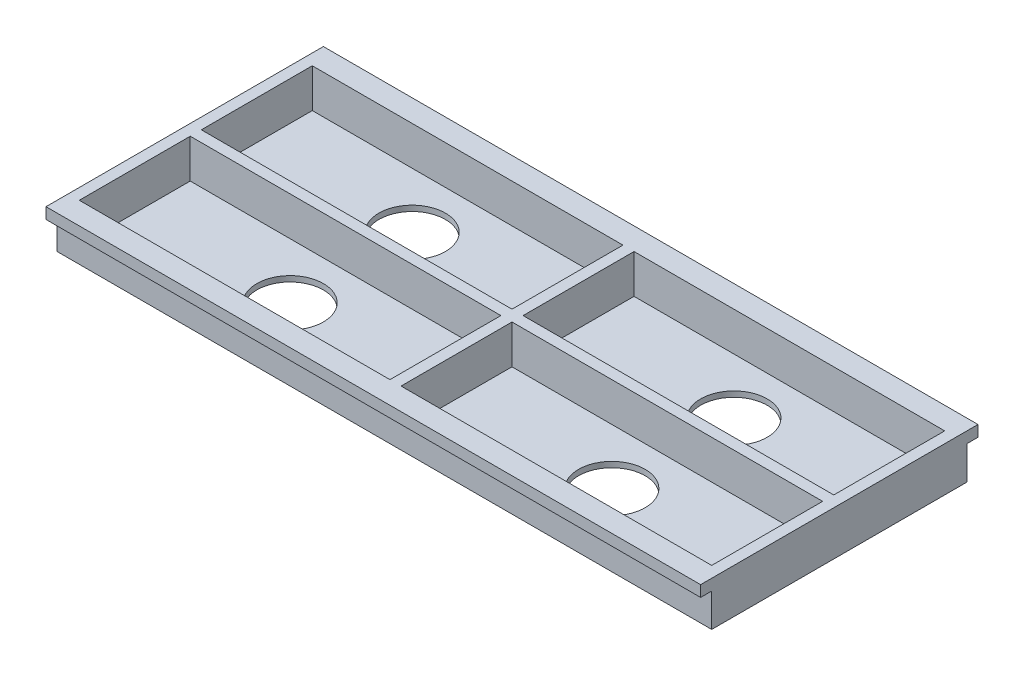
ISO-10303-21;
HEADER;
FILE_DESCRIPTION(('STEP AP214'),'2;1');
FILE_NAME('part.step','',(''),(''),'','','');
FILE_SCHEMA(('AUTOMOTIVE_DESIGN { 1 0 10303 214 1 1 1 1 }'));
ENDSEC;
DATA;
#1=APPLICATION_CONTEXT('core data for automotive mechanical design processes');
#2=APPLICATION_PROTOCOL_DEFINITION('international standard','automotive_design',2000,#1);
#3=PRODUCT_CONTEXT('',#1,'mechanical');
#4=PRODUCT('Part','Part','',(#3));
#5=PRODUCT_RELATED_PRODUCT_CATEGORY('part','',(#4));
#6=PRODUCT_DEFINITION_FORMATION('','',#4);
#7=PRODUCT_DEFINITION_CONTEXT('part definition',#1,'design');
#8=PRODUCT_DEFINITION('design','',#6,#7);
#9=PRODUCT_DEFINITION_SHAPE('','',#8);
#10=(LENGTH_UNIT() NAMED_UNIT(*) SI_UNIT(.MILLI.,.METRE.));
#11=(NAMED_UNIT(*) PLANE_ANGLE_UNIT() SI_UNIT($,.RADIAN.));
#12=(NAMED_UNIT(*) SI_UNIT($,.STERADIAN.) SOLID_ANGLE_UNIT());
#13=UNCERTAINTY_MEASURE_WITH_UNIT(LENGTH_MEASURE(1.E-05),#10,'distance_accuracy_value','');
#14=(GEOMETRIC_REPRESENTATION_CONTEXT(3) GLOBAL_UNCERTAINTY_ASSIGNED_CONTEXT((#13)) GLOBAL_UNIT_ASSIGNED_CONTEXT((#10,
#11,#12)) REPRESENTATION_CONTEXT('',''));
#15=CARTESIAN_POINT('',(0.,0.,0.));
#16=DIRECTION('',(0.,0.,1.));
#17=DIRECTION('',(1.,0.,0.));
#18=AXIS2_PLACEMENT_3D('',#15,#16,#17);
#19=CARTESIAN_POINT('',(0.,-4.99999999999999,0.));
#20=DIRECTION('',(0.,-1.,0.));
#21=DIRECTION('',(0.,0.,-1.));
#22=AXIS2_PLACEMENT_3D('',#19,#20,#21);
#23=PLANE('',#22);
#24=DIRECTION('',(1.,0.,0.));
#25=VECTOR('',#24,1.);
#26=CARTESIAN_POINT('',(0.,-4.99999999999999,-80.7628298837464));
#27=LINE('',#26,#25);
#28=CARTESIAN_POINT('',(-123.155339805825,-4.99999999999999,-80.7628298837464));
#29=VERTEX_POINT('',#28);
#30=CARTESIAN_POINT('',(171.844660194175,-4.99999999999999,-80.7628298837464));
#31=VERTEX_POINT('',#30);
#32=EDGE_CURVE('E426',#29,#31,#27,.T.);
#33=ORIENTED_EDGE('',*,*,#32,.F.);
#34=DIRECTION('',(0.,0.,1.));
#35=VECTOR('',#34,1.);
#36=CARTESIAN_POINT('',(-123.155339805825,-4.99999999999999,-85.7628298837464));
#37=LINE('',#36,#35);
#38=CARTESIAN_POINT('',(-123.155339805825,-4.99999999999999,-85.7628298837464));
#39=VERTEX_POINT('',#38);
#40=EDGE_CURVE('E444',#39,#29,#37,.T.);
#41=ORIENTED_EDGE('',*,*,#40,.F.);
#42=DIRECTION('',(1.,0.,0.));
#43=VECTOR('',#42,1.);
#44=CARTESIAN_POINT('',(-123.155339805825,-4.99999999999999,-85.7628298837464));
#45=LINE('',#44,#43);
#46=CARTESIAN_POINT('',(171.844660194175,-4.99999999999999,-85.7628298837464));
#47=VERTEX_POINT('',#46);
#48=EDGE_CURVE('E440',#39,#47,#45,.T.);
#49=ORIENTED_EDGE('',*,*,#48,.T.);
#50=DIRECTION('',(0.,0.,1.));
#51=VECTOR('',#50,1.);
#52=CARTESIAN_POINT('',(171.844660194175,-4.99999999999999,-85.7628298837464));
#53=LINE('',#52,#51);
#54=EDGE_CURVE('E437',#47,#31,#53,.T.);
#55=ORIENTED_EDGE('',*,*,#54,.T.);
#56=EDGE_LOOP('',(#33,#41,#49,#55));
#57=FACE_BOUND('',#56,.T.);
#58=ADVANCED_FACE('F43',(#57),#23,.T.);
#59=CARTESIAN_POINT('',(-123.155339805825,-4.99999999999999,39.2371701162536));
#60=DIRECTION('',(0.,0.,1.));
#61=DIRECTION('',(1.,0.,0.));
#62=AXIS2_PLACEMENT_3D('',#59,#60,#61);
#63=PLANE('',#62);
#64=DIRECTION('',(1.,0.,0.));
#65=VECTOR('',#64,1.);
#66=CARTESIAN_POINT('',(-123.155339805825,0.,39.2371701162536));
#67=LINE('',#66,#65);
#68=CARTESIAN_POINT('',(-123.155339805825,0.,39.2371701162536));
#69=VERTEX_POINT('',#68);
#70=CARTESIAN_POINT('',(171.844660194175,0.,39.2371701162536));
#71=VERTEX_POINT('',#70);
#72=EDGE_CURVE('E430',#69,#71,#67,.T.);
#73=ORIENTED_EDGE('',*,*,#72,.F.);
#74=DIRECTION('',(0.,1.,0.));
#75=VECTOR('',#74,1.);
#76=CARTESIAN_POINT('',(-123.155339805825,-4.99999999999999,39.2371701162536));
#77=LINE('',#76,#75);
#78=CARTESIAN_POINT('',(-123.155339805825,-4.99999999999999,39.2371701162536));
#79=VERTEX_POINT('',#78);
#80=EDGE_CURVE('E11',#79,#69,#77,.T.);
#81=ORIENTED_EDGE('',*,*,#80,.F.);
#82=DIRECTION('',(1.,0.,0.));
#83=VECTOR('',#82,1.);
#84=CARTESIAN_POINT('',(-123.155339805825,-4.99999999999999,39.2371701162536));
#85=LINE('',#84,#83);
#86=CARTESIAN_POINT('',(171.844660194175,-4.99999999999999,39.2371701162536));
#87=VERTEX_POINT('',#86);
#88=EDGE_CURVE('E431',#79,#87,#85,.T.);
#89=ORIENTED_EDGE('',*,*,#88,.T.);
#90=DIRECTION('',(0.,1.,0.));
#91=VECTOR('',#90,1.);
#92=CARTESIAN_POINT('',(171.844660194175,-4.99999999999999,39.2371701162536));
#93=LINE('',#92,#91);
#94=EDGE_CURVE('E448',#87,#71,#93,.T.);
#95=ORIENTED_EDGE('',*,*,#94,.T.);
#96=EDGE_LOOP('',(#73,#81,#89,#95));
#97=FACE_BOUND('',#96,.T.);
#98=ADVANCED_FACE('F45',(#97),#63,.T.);
#99=CARTESIAN_POINT('',(-123.155339805825,-4.99999999999999,-85.7628298837464));
#100=DIRECTION('',(-1.,0.,0.));
#101=DIRECTION('',(0.,0.,1.));
#102=AXIS2_PLACEMENT_3D('',#99,#100,#101);
#103=PLANE('',#102);
#104=ORIENTED_EDGE('',*,*,#80,.T.);
#105=DIRECTION('',(0.,0.,1.));
#106=VECTOR('',#105,1.);
#107=CARTESIAN_POINT('',(-123.155339805825,0.,-85.7628298837464));
#108=LINE('',#107,#106);
#109=CARTESIAN_POINT('',(-123.155339805825,0.,-85.7628298837464));
#110=VERTEX_POINT('',#109);
#111=EDGE_CURVE('E436',#110,#69,#108,.T.);
#112=ORIENTED_EDGE('',*,*,#111,.F.);
#113=DIRECTION('',(0.,1.,0.));
#114=VECTOR('',#113,1.);
#115=CARTESIAN_POINT('',(-123.155339805825,-4.99999999999999,-85.7628298837464));
#116=LINE('',#115,#114);
#117=EDGE_CURVE('E53',#39,#110,#116,.T.);
#118=ORIENTED_EDGE('',*,*,#117,.F.);
#119=ORIENTED_EDGE('',*,*,#40,.T.);
#120=DIRECTION('',(0.,1.,0.));
#121=VECTOR('',#120,1.);
#122=CARTESIAN_POINT('',(-123.155339805825,-20.,-80.7628298837464));
#123=LINE('',#122,#121);
#124=CARTESIAN_POINT('',(-123.155339805825,-20.,-80.7628298837464));
#125=VERTEX_POINT('',#124);
#126=EDGE_CURVE('E407',#125,#29,#123,.T.);
#127=ORIENTED_EDGE('',*,*,#126,.F.);
#128=DIRECTION('',(0.,0.,1.));
#129=VECTOR('',#128,1.);
#130=CARTESIAN_POINT('',(-123.155339805825,-20.,-80.7628298837464));
#131=LINE('',#130,#129);
#132=CARTESIAN_POINT('',(-123.155339805825,-20.,34.2371701162536));
#133=VERTEX_POINT('',#132);
#134=EDGE_CURVE('E381',#125,#133,#131,.T.);
#135=ORIENTED_EDGE('',*,*,#134,.T.);
#136=DIRECTION('',(0.,1.,0.));
#137=VECTOR('',#136,1.);
#138=CARTESIAN_POINT('',(-123.155339805825,-20.,34.2371701162536));
#139=LINE('',#138,#137);
#140=CARTESIAN_POINT('',(-123.155339805825,-4.99999999999999,34.2371701162536));
#141=VERTEX_POINT('',#140);
#142=EDGE_CURVE('E406',#133,#141,#139,.T.);
#143=ORIENTED_EDGE('',*,*,#142,.T.);
#144=EDGE_CURVE('E443',#141,#79,#37,.T.);
#145=ORIENTED_EDGE('',*,*,#144,.T.);
#146=EDGE_LOOP('',(#104,#112,#118,#119,#127,#135,#143,#145));
#147=FACE_BOUND('',#146,.T.);
#148=ADVANCED_FACE('F507',(#147),#103,.T.);
#149=CARTESIAN_POINT('',(-123.155339805825,-4.99999999999999,-85.7628298837464));
#150=DIRECTION('',(0.,0.,1.));
#151=DIRECTION('',(1.,0.,0.));
#152=AXIS2_PLACEMENT_3D('',#149,#150,#151);
#153=PLANE('',#152);
#154=DIRECTION('',(1.,0.,0.));
#155=VECTOR('',#154,1.);
#156=CARTESIAN_POINT('',(-123.155339805825,0.,-85.7628298837464));
#157=LINE('',#156,#155);
#158=CARTESIAN_POINT('',(171.844660194175,0.,-85.7628298837464));
#159=VERTEX_POINT('',#158);
#160=EDGE_CURVE('E455',#110,#159,#157,.T.);
#161=ORIENTED_EDGE('',*,*,#160,.T.);
#162=DIRECTION('',(0.,1.,0.));
#163=VECTOR('',#162,1.);
#164=CARTESIAN_POINT('',(171.844660194175,-4.99999999999999,-85.7628298837464));
#165=LINE('',#164,#163);
#166=EDGE_CURVE('E462',#47,#159,#165,.T.);
#167=ORIENTED_EDGE('',*,*,#166,.F.);
#168=ORIENTED_EDGE('',*,*,#48,.F.);
#169=ORIENTED_EDGE('',*,*,#117,.T.);
#170=EDGE_LOOP('',(#161,#167,#168,#169));
#171=FACE_BOUND('',#170,.T.);
#172=ADVANCED_FACE('F521',(#171),#153,.F.);
#173=CARTESIAN_POINT('',(171.844660194175,-4.99999999999999,-85.7628298837464));
#174=DIRECTION('',(-1.,0.,0.));
#175=DIRECTION('',(0.,0.,1.));
#176=AXIS2_PLACEMENT_3D('',#173,#174,#175);
#177=PLANE('',#176);
#178=CARTESIAN_POINT('',(171.844660194175,-4.99999999999999,34.2371701162536));
#179=VERTEX_POINT('',#178);
#180=EDGE_CURVE('E435',#179,#87,#53,.T.);
#181=ORIENTED_EDGE('',*,*,#180,.F.);
#182=DIRECTION('',(0.,1.,0.));
#183=VECTOR('',#182,1.);
#184=CARTESIAN_POINT('',(171.844660194175,-20.,34.2371701162536));
#185=LINE('',#184,#183);
#186=CARTESIAN_POINT('',(171.844660194175,-20.,34.2371701162536));
#187=VERTEX_POINT('',#186);
#188=EDGE_CURVE('E416',#187,#179,#185,.T.);
#189=ORIENTED_EDGE('',*,*,#188,.F.);
#190=DIRECTION('',(0.,0.,-1.));
#191=VECTOR('',#190,1.);
#192=CARTESIAN_POINT('',(171.844660194175,-20.,-80.7628298837464));
#193=LINE('',#192,#191);
#194=CARTESIAN_POINT('',(171.844660194175,-20.,-80.7628298837464));
#195=VERTEX_POINT('',#194);
#196=EDGE_CURVE('E398',#187,#195,#193,.T.);
#197=ORIENTED_EDGE('',*,*,#196,.T.);
#198=DIRECTION('',(0.,1.,0.));
#199=VECTOR('',#198,1.);
#200=CARTESIAN_POINT('',(171.844660194175,-20.,-80.7628298837464));
#201=LINE('',#200,#199);
#202=EDGE_CURVE('E412',#195,#31,#201,.T.);
#203=ORIENTED_EDGE('',*,*,#202,.T.);
#204=ORIENTED_EDGE('',*,*,#54,.F.);
#205=ORIENTED_EDGE('',*,*,#166,.T.);
#206=DIRECTION('',(0.,0.,1.));
#207=VECTOR('',#206,1.);
#208=CARTESIAN_POINT('',(171.844660194175,0.,-85.7628298837464));
#209=LINE('',#208,#207);
#210=EDGE_CURVE('E452',#159,#71,#209,.T.);
#211=ORIENTED_EDGE('',*,*,#210,.T.);
#212=ORIENTED_EDGE('',*,*,#94,.F.);
#213=EDGE_LOOP('',(#181,#189,#197,#203,#204,#205,#211,#212));
#214=FACE_BOUND('',#213,.T.);
#215=ADVANCED_FACE('F513',(#214),#177,.F.);
#216=DIRECTION('',(-1.,0.,0.));
#217=VECTOR('',#216,1.);
#218=CARTESIAN_POINT('',(0.,-4.99999999999999,34.2371701162536));
#219=LINE('',#218,#217);
#220=EDGE_CURVE('E411',#179,#141,#219,.T.);
#221=ORIENTED_EDGE('',*,*,#220,.F.);
#222=ORIENTED_EDGE('',*,*,#180,.T.);
#223=ORIENTED_EDGE('',*,*,#88,.F.);
#224=ORIENTED_EDGE('',*,*,#144,.F.);
#225=EDGE_LOOP('',(#221,#222,#223,#224));
#226=FACE_BOUND('',#225,.T.);
#227=ADVANCED_FACE('F503',(#226),#23,.T.);
#228=CARTESIAN_POINT('',(0.,0.,0.));
#229=DIRECTION('',(0.,-1.,0.));
#230=DIRECTION('',(0.,0.,-1.));
#231=AXIS2_PLACEMENT_3D('',#228,#229,#230);
#232=PLANE('',#231);
#233=DIRECTION('',(0.,0.,1.));
#234=VECTOR('',#233,1.);
#235=CARTESIAN_POINT('',(-118.155339805825,0.,-20.7628298837464));
#236=LINE('',#235,#234);
#237=CARTESIAN_POINT('',(-118.155339805825,0.,-20.7628298837464));
#238=VERTEX_POINT('',#237);
#239=CARTESIAN_POINT('',(-118.155339805825,0.,29.2371701162536));
#240=VERTEX_POINT('',#239);
#241=EDGE_CURVE('E328',#238,#240,#236,.T.);
#242=ORIENTED_EDGE('',*,*,#241,.F.);
#243=DIRECTION('',(-1.,0.,0.));
#244=VECTOR('',#243,1.);
#245=CARTESIAN_POINT('',(-118.155339805825,0.,-20.7628298837464));
#246=LINE('',#245,#244);
#247=CARTESIAN_POINT('',(21.8446601941753,0.,-20.7628298837464));
#248=VERTEX_POINT('',#247);
#249=EDGE_CURVE('E61',#248,#238,#246,.T.);
#250=ORIENTED_EDGE('',*,*,#249,.F.);
#251=DIRECTION('',(0.,0.,-1.));
#252=VECTOR('',#251,1.);
#253=CARTESIAN_POINT('',(21.8446601941753,0.,-20.7628298837464));
#254=LINE('',#253,#252);
#255=CARTESIAN_POINT('',(21.8446601941754,0.,29.2371701162536));
#256=VERTEX_POINT('',#255);
#257=EDGE_CURVE('E313',#256,#248,#254,.T.);
#258=ORIENTED_EDGE('',*,*,#257,.F.);
#259=DIRECTION('',(1.,0.,0.));
#260=VECTOR('',#259,1.);
#261=CARTESIAN_POINT('',(-118.155339805825,0.,29.2371701162536));
#262=LINE('',#261,#260);
#263=EDGE_CURVE('E332',#240,#256,#262,.T.);
#264=ORIENTED_EDGE('',*,*,#263,.F.);
#265=EDGE_LOOP('',(#242,#250,#258,#264));
#266=FACE_BOUND('',#265,.T.);
#267=DIRECTION('',(0.,0.,1.));
#268=VECTOR('',#267,1.);
#269=CARTESIAN_POINT('',(26.8446601941753,0.,-20.7628298837464));
#270=LINE('',#269,#268);
#271=CARTESIAN_POINT('',(26.8446601941753,0.,-20.7628298837464));
#272=VERTEX_POINT('',#271);
#273=CARTESIAN_POINT('',(26.8446601941753,0.,29.2371701162536));
#274=VERTEX_POINT('',#273);
#275=EDGE_CURVE('E286',#272,#274,#270,.T.);
#276=ORIENTED_EDGE('',*,*,#275,.F.);
#277=DIRECTION('',(-1.,0.,0.));
#278=VECTOR('',#277,1.);
#279=CARTESIAN_POINT('',(26.8446601941753,0.,-20.7628298837464));
#280=LINE('',#279,#278);
#281=CARTESIAN_POINT('',(166.844660194175,0.,-20.7628298837464));
#282=VERTEX_POINT('',#281);
#283=EDGE_CURVE('E69',#282,#272,#280,.T.);
#284=ORIENTED_EDGE('',*,*,#283,.F.);
#285=DIRECTION('',(0.,0.,-1.));
#286=VECTOR('',#285,1.);
#287=CARTESIAN_POINT('',(166.844660194175,0.,-20.7628298837464));
#288=LINE('',#287,#286);
#289=CARTESIAN_POINT('',(166.844660194175,0.,29.2371701162536));
#290=VERTEX_POINT('',#289);
#291=EDGE_CURVE('E271',#290,#282,#288,.T.);
#292=ORIENTED_EDGE('',*,*,#291,.F.);
#293=DIRECTION('',(1.,0.,0.));
#294=VECTOR('',#293,1.);
#295=CARTESIAN_POINT('',(26.8446601941753,0.,29.2371701162536));
#296=LINE('',#295,#294);
#297=EDGE_CURVE('E291',#274,#290,#296,.T.);
#298=ORIENTED_EDGE('',*,*,#297,.F.);
#299=EDGE_LOOP('',(#276,#284,#292,#298));
#300=FACE_BOUND('',#299,.T.);
#301=DIRECTION('',(0.,0.,1.));
#302=VECTOR('',#301,1.);
#303=CARTESIAN_POINT('',(26.8446601941748,0.,-75.7628298837464));
#304=LINE('',#303,#302);
#305=CARTESIAN_POINT('',(26.8446601941748,0.,-75.7628298837464));
#306=VERTEX_POINT('',#305);
#307=CARTESIAN_POINT('',(26.8446601941748,0.,-25.7628298837464));
#308=VERTEX_POINT('',#307);
#309=EDGE_CURVE('E250',#306,#308,#304,.T.);
#310=ORIENTED_EDGE('',*,*,#309,.F.);
#311=DIRECTION('',(-1.,0.,0.));
#312=VECTOR('',#311,1.);
#313=CARTESIAN_POINT('',(26.8446601941748,0.,-75.7628298837464));
#314=LINE('',#313,#312);
#315=CARTESIAN_POINT('',(166.844660194175,0.,-75.7628298837464));
#316=VERTEX_POINT('',#315);
#317=EDGE_CURVE('E214',#316,#306,#314,.T.);
#318=ORIENTED_EDGE('',*,*,#317,.F.);
#319=DIRECTION('',(0.,0.,-1.));
#320=VECTOR('',#319,1.);
#321=CARTESIAN_POINT('',(166.844660194175,0.,-75.7628298837464));
#322=LINE('',#321,#320);
#323=CARTESIAN_POINT('',(166.844660194175,0.,-25.7628298837464));
#324=VERTEX_POINT('',#323);
#325=EDGE_CURVE('E234',#324,#316,#322,.T.);
#326=ORIENTED_EDGE('',*,*,#325,.F.);
#327=DIRECTION('',(1.,0.,0.));
#328=VECTOR('',#327,1.);
#329=CARTESIAN_POINT('',(26.8446601941748,0.,-25.7628298837464));
#330=LINE('',#329,#328);
#331=EDGE_CURVE('E238',#308,#324,#330,.T.);
#332=ORIENTED_EDGE('',*,*,#331,.F.);
#333=EDGE_LOOP('',(#310,#318,#326,#332));
#334=FACE_BOUND('',#333,.T.);
#335=DIRECTION('',(1.,0.,0.));
#336=VECTOR('',#335,1.);
#337=CARTESIAN_POINT('',(-118.155339805825,0.,-25.7628298837464));
#338=LINE('',#337,#336);
#339=CARTESIAN_POINT('',(-118.155339805825,0.,-25.7628298837464));
#340=VERTEX_POINT('',#339);
#341=CARTESIAN_POINT('',(21.8446601941748,0.,-25.7628298837464));
#342=VERTEX_POINT('',#341);
#343=EDGE_CURVE('E367',#340,#342,#338,.T.);
#344=ORIENTED_EDGE('',*,*,#343,.F.);
#345=DIRECTION('',(0.,0.,1.));
#346=VECTOR('',#345,1.);
#347=CARTESIAN_POINT('',(-118.155339805825,0.,-75.7628298837464));
#348=LINE('',#347,#346);
#349=CARTESIAN_POINT('',(-118.155339805825,0.,-75.7628298837464));
#350=VERTEX_POINT('',#349);
#351=EDGE_CURVE('E260',#350,#340,#348,.T.);
#352=ORIENTED_EDGE('',*,*,#351,.F.);
#353=DIRECTION('',(1.,0.,0.));
#354=VECTOR('',#353,1.);
#355=CARTESIAN_POINT('',(-118.155339805825,0.,-75.7628298837464));
#356=LINE('',#355,#354);
#357=CARTESIAN_POINT('',(21.8446601941748,0.,-75.7628298837464));
#358=VERTEX_POINT('',#357);
#359=EDGE_CURVE('E354',#350,#358,#356,.T.);
#360=ORIENTED_EDGE('',*,*,#359,.T.);
#361=DIRECTION('',(0.,0.,1.));
#362=VECTOR('',#361,1.);
#363=CARTESIAN_POINT('',(21.8446601941748,0.,-75.7628298837464));
#364=LINE('',#363,#362);
#365=EDGE_CURVE('E371',#358,#342,#364,.T.);
#366=ORIENTED_EDGE('',*,*,#365,.T.);
#367=EDGE_LOOP('',(#344,#352,#360,#366));
#368=FACE_BOUND('',#367,.T.);
#369=ORIENTED_EDGE('',*,*,#72,.T.);
#370=ORIENTED_EDGE('',*,*,#210,.F.);
#371=ORIENTED_EDGE('',*,*,#160,.F.);
#372=ORIENTED_EDGE('',*,*,#111,.T.);
#373=EDGE_LOOP('',(#369,#370,#371,#372));
#374=FACE_BOUND('',#373,.T.);
#375=ADVANCED_FACE('F512',(#266,#300,#334,#368,#374),#232,.F.);
#376=CARTESIAN_POINT('',(-123.155339805825,-20.,-80.7628298837464));
#377=DIRECTION('',(0.,0.,-1.));
#378=DIRECTION('',(-1.,0.,0.));
#379=AXIS2_PLACEMENT_3D('',#376,#377,#378);
#380=PLANE('',#379);
#381=ORIENTED_EDGE('',*,*,#126,.T.);
#382=ORIENTED_EDGE('',*,*,#32,.T.);
#383=ORIENTED_EDGE('',*,*,#202,.F.);
#384=DIRECTION('',(-1.,0.,0.));
#385=VECTOR('',#384,1.);
#386=CARTESIAN_POINT('',(-123.155339805825,-20.,-80.7628298837464));
#387=LINE('',#386,#385);
#388=EDGE_CURVE('E402',#195,#125,#387,.T.);
#389=ORIENTED_EDGE('',*,*,#388,.T.);
#390=EDGE_LOOP('',(#381,#382,#383,#389));
#391=FACE_BOUND('',#390,.T.);
#392=ADVANCED_FACE('F519',(#391),#380,.T.);
#393=CARTESIAN_POINT('',(-123.155339805825,-20.,34.2371701162536));
#394=DIRECTION('',(0.,0.,1.));
#395=DIRECTION('',(1.,0.,0.));
#396=AXIS2_PLACEMENT_3D('',#393,#394,#395);
#397=PLANE('',#396);
#398=ORIENTED_EDGE('',*,*,#188,.T.);
#399=ORIENTED_EDGE('',*,*,#220,.T.);
#400=ORIENTED_EDGE('',*,*,#142,.F.);
#401=DIRECTION('',(1.,0.,0.));
#402=VECTOR('',#401,1.);
#403=CARTESIAN_POINT('',(-123.155339805825,-20.,34.2371701162536));
#404=LINE('',#403,#402);
#405=EDGE_CURVE('E394',#133,#187,#404,.T.);
#406=ORIENTED_EDGE('',*,*,#405,.T.);
#407=EDGE_LOOP('',(#398,#399,#400,#406));
#408=FACE_BOUND('',#407,.T.);
#409=ADVANCED_FACE('F529',(#408),#397,.T.);
#410=CARTESIAN_POINT('',(0.,-20.,0.));
#411=DIRECTION('',(0.,1.,0.));
#412=DIRECTION('',(0.,0.,1.));
#413=AXIS2_PLACEMENT_3D('',#410,#411,#412);
#414=PLANE('',#413);
#415=CARTESIAN_POINT('',(-48.1553398058248,-20.,-50.7628298837464));
#416=DIRECTION('',(0.,1.,0.));
#417=DIRECTION('',(0.,0.,1.));
#418=AXIS2_PLACEMENT_3D('',#415,#416,#417);
#419=CIRCLE('',#418,15.);
#420=CARTESIAN_POINT('',(-48.1553398058248,-20.,-35.7628298837464));
#421=VERTEX_POINT('',#420);
#422=EDGE_CURVE('E47',#421,#421,#419,.T.);
#423=ORIENTED_EDGE('',*,*,#422,.T.);
#424=EDGE_LOOP('',(#423));
#425=FACE_BOUND('',#424,.T.);
#426=CARTESIAN_POINT('',(96.8446601941751,-20.,-50.7628298837464));
#427=DIRECTION('',(0.,1.,0.));
#428=DIRECTION('',(0.,0.,1.));
#429=AXIS2_PLACEMENT_3D('',#426,#427,#428);
#430=CIRCLE('',#429,15.);
#431=CARTESIAN_POINT('',(96.8446601941751,-20.,-35.7628298837464));
#432=VERTEX_POINT('',#431);
#433=EDGE_CURVE('E476',#432,#432,#430,.T.);
#434=ORIENTED_EDGE('',*,*,#433,.T.);
#435=EDGE_LOOP('',(#434));
#436=FACE_BOUND('',#435,.T.);
#437=CARTESIAN_POINT('',(96.8446601941753,-20.,4.23717011625363));
#438=DIRECTION('',(0.,1.,0.));
#439=DIRECTION('',(0.,0.,1.));
#440=AXIS2_PLACEMENT_3D('',#437,#438,#439);
#441=CIRCLE('',#440,15.);
#442=CARTESIAN_POINT('',(96.8446601941753,-20.,19.2371701162536));
#443=VERTEX_POINT('',#442);
#444=EDGE_CURVE('E473',#443,#443,#441,.T.);
#445=ORIENTED_EDGE('',*,*,#444,.T.);
#446=EDGE_LOOP('',(#445));
#447=FACE_BOUND('',#446,.T.);
#448=CARTESIAN_POINT('',(-48.1553398058246,-20.,4.23717011625363));
#449=DIRECTION('',(0.,1.,0.));
#450=DIRECTION('',(0.,0.,1.));
#451=AXIS2_PLACEMENT_3D('',#448,#449,#450);
#452=CIRCLE('',#451,15.);
#453=CARTESIAN_POINT('',(-48.1553398058246,-20.,19.2371701162536));
#454=VERTEX_POINT('',#453);
#455=EDGE_CURVE('E469',#454,#454,#452,.T.);
#456=ORIENTED_EDGE('',*,*,#455,.T.);
#457=EDGE_LOOP('',(#456));
#458=FACE_BOUND('',#457,.T.);
#459=ORIENTED_EDGE('',*,*,#134,.F.);
#460=ORIENTED_EDGE('',*,*,#388,.F.);
#461=ORIENTED_EDGE('',*,*,#196,.F.);
#462=ORIENTED_EDGE('',*,*,#405,.F.);
#463=EDGE_LOOP('',(#459,#460,#461,#462));
#464=FACE_BOUND('',#463,.T.);
#465=ADVANCED_FACE('F485',(#425,#436,#447,#458,#464),#414,.F.);
#466=CARTESIAN_POINT('',(-118.155339805825,-17.5,-75.7628298837464));
#467=DIRECTION('',(-1.,0.,0.));
#468=DIRECTION('',(0.,0.,1.));
#469=AXIS2_PLACEMENT_3D('',#466,#467,#468);
#470=PLANE('',#469);
#471=ORIENTED_EDGE('',*,*,#351,.T.);
#472=DIRECTION('',(0.,1.,0.));
#473=VECTOR('',#472,1.);
#474=CARTESIAN_POINT('',(-118.155339805825,-17.5,-25.7628298837464));
#475=LINE('',#474,#473);
#476=CARTESIAN_POINT('',(-118.155339805825,-17.5,-25.7628298837464));
#477=VERTEX_POINT('',#476);
#478=EDGE_CURVE('E364',#477,#340,#475,.T.);
#479=ORIENTED_EDGE('',*,*,#478,.F.);
#480=DIRECTION('',(0.,0.,1.));
#481=VECTOR('',#480,1.);
#482=CARTESIAN_POINT('',(-118.155339805825,-17.5,-75.7628298837464));
#483=LINE('',#482,#481);
#484=CARTESIAN_POINT('',(-118.155339805825,-17.5,-75.7628298837464));
#485=VERTEX_POINT('',#484);
#486=EDGE_CURVE('E349',#485,#477,#483,.T.);
#487=ORIENTED_EDGE('',*,*,#486,.F.);
#488=DIRECTION('',(0.,1.,0.));
#489=VECTOR('',#488,1.);
#490=CARTESIAN_POINT('',(-118.155339805825,-17.5,-75.7628298837464));
#491=LINE('',#490,#489);
#492=EDGE_CURVE('E378',#485,#350,#491,.T.);
#493=ORIENTED_EDGE('',*,*,#492,.T.);
#494=EDGE_LOOP('',(#471,#479,#487,#493));
#495=FACE_BOUND('',#494,.T.);
#496=ADVANCED_FACE('F604',(#495),#470,.F.);
#497=CARTESIAN_POINT('',(-118.155339805825,-17.5,-75.7628298837464));
#498=DIRECTION('',(0.,0.,1.));
#499=DIRECTION('',(1.,0.,0.));
#500=AXIS2_PLACEMENT_3D('',#497,#498,#499);
#501=PLANE('',#500);
#502=ORIENTED_EDGE('',*,*,#359,.F.);
#503=ORIENTED_EDGE('',*,*,#492,.F.);
#504=DIRECTION('',(1.,0.,0.));
#505=VECTOR('',#504,1.);
#506=CARTESIAN_POINT('',(-118.155339805825,-17.5,-75.7628298837464));
#507=LINE('',#506,#505);
#508=CARTESIAN_POINT('',(21.8446601941748,-17.5,-75.7628298837464));
#509=VERTEX_POINT('',#508);
#510=EDGE_CURVE('E361',#485,#509,#507,.T.);
#511=ORIENTED_EDGE('',*,*,#510,.T.);
#512=DIRECTION('',(0.,1.,0.));
#513=VECTOR('',#512,1.);
#514=CARTESIAN_POINT('',(21.8446601941748,-17.5,-75.7628298837464));
#515=LINE('',#514,#513);
#516=EDGE_CURVE('E382',#509,#358,#515,.T.);
#517=ORIENTED_EDGE('',*,*,#516,.T.);
#518=EDGE_LOOP('',(#502,#503,#511,#517));
#519=FACE_BOUND('',#518,.T.);
#520=ADVANCED_FACE('F613',(#519),#501,.T.);
#521=CARTESIAN_POINT('',(21.8446601941748,-17.5,-75.7628298837464));
#522=DIRECTION('',(-1.,0.,0.));
#523=DIRECTION('',(0.,0.,1.));
#524=AXIS2_PLACEMENT_3D('',#521,#522,#523);
#525=PLANE('',#524);
#526=ORIENTED_EDGE('',*,*,#365,.F.);
#527=ORIENTED_EDGE('',*,*,#516,.F.);
#528=DIRECTION('',(0.,0.,1.));
#529=VECTOR('',#528,1.);
#530=CARTESIAN_POINT('',(21.8446601941748,-17.5,-75.7628298837464));
#531=LINE('',#530,#529);
#532=CARTESIAN_POINT('',(21.8446601941748,-17.5,-25.7628298837464));
#533=VERTEX_POINT('',#532);
#534=EDGE_CURVE('E358',#509,#533,#531,.T.);
#535=ORIENTED_EDGE('',*,*,#534,.T.);
#536=DIRECTION('',(0.,1.,0.));
#537=VECTOR('',#536,1.);
#538=CARTESIAN_POINT('',(21.8446601941748,-17.5,-25.7628298837464));
#539=LINE('',#538,#537);
#540=EDGE_CURVE('E385',#533,#342,#539,.T.);
#541=ORIENTED_EDGE('',*,*,#540,.T.);
#542=EDGE_LOOP('',(#526,#527,#535,#541));
#543=FACE_BOUND('',#542,.T.);
#544=ADVANCED_FACE('F623',(#543),#525,.T.);
#545=CARTESIAN_POINT('',(-118.155339805825,-17.5,-25.7628298837464));
#546=DIRECTION('',(0.,0.,1.));
#547=DIRECTION('',(1.,0.,0.));
#548=AXIS2_PLACEMENT_3D('',#545,#546,#547);
#549=PLANE('',#548);
#550=ORIENTED_EDGE('',*,*,#343,.T.);
#551=ORIENTED_EDGE('',*,*,#540,.F.);
#552=DIRECTION('',(1.,0.,0.));
#553=VECTOR('',#552,1.);
#554=CARTESIAN_POINT('',(-118.155339805825,-17.5,-25.7628298837464));
#555=LINE('',#554,#553);
#556=EDGE_CURVE('E353',#477,#533,#555,.T.);
#557=ORIENTED_EDGE('',*,*,#556,.F.);
#558=ORIENTED_EDGE('',*,*,#478,.T.);
#559=EDGE_LOOP('',(#550,#551,#557,#558));
#560=FACE_BOUND('',#559,.T.);
#561=ADVANCED_FACE('F633',(#560),#549,.F.);
#562=CARTESIAN_POINT('',(0.,-17.5,0.));
#563=DIRECTION('',(0.,1.,0.));
#564=DIRECTION('',(0.,0.,1.));
#565=AXIS2_PLACEMENT_3D('',#562,#563,#564);
#566=PLANE('',#565);
#567=CARTESIAN_POINT('',(-48.1553398058248,-17.5,-50.7628298837464));
#568=DIRECTION('',(0.,1.,0.));
#569=DIRECTION('',(0.,0.,1.));
#570=AXIS2_PLACEMENT_3D('',#567,#568,#569);
#571=CIRCLE('',#570,15.);
#572=CARTESIAN_POINT('',(-48.1553398058248,-17.5,-35.7628298837464));
#573=VERTEX_POINT('',#572);
#574=EDGE_CURVE('E924',#573,#573,#571,.T.);
#575=ORIENTED_EDGE('',*,*,#574,.F.);
#576=EDGE_LOOP('',(#575));
#577=FACE_BOUND('',#576,.T.);
#578=ORIENTED_EDGE('',*,*,#486,.T.);
#579=ORIENTED_EDGE('',*,*,#556,.T.);
#580=ORIENTED_EDGE('',*,*,#534,.F.);
#581=ORIENTED_EDGE('',*,*,#510,.F.);
#582=EDGE_LOOP('',(#578,#579,#580,#581));
#583=FACE_BOUND('',#582,.T.);
#584=ADVANCED_FACE('F643',(#577,#583),#566,.T.);
#585=CARTESIAN_POINT('',(26.8446601941748,-17.5,-75.7628298837464));
#586=DIRECTION('',(0.,0.,-1.));
#587=DIRECTION('',(-1.,0.,0.));
#588=AXIS2_PLACEMENT_3D('',#585,#586,#587);
#589=PLANE('',#588);
#590=ORIENTED_EDGE('',*,*,#317,.T.);
#591=DIRECTION('',(0.,1.,0.));
#592=VECTOR('',#591,1.);
#593=CARTESIAN_POINT('',(26.8446601941748,-17.5,-75.7628298837464));
#594=LINE('',#593,#592);
#595=CARTESIAN_POINT('',(26.8446601941748,-17.5,-75.7628298837464));
#596=VERTEX_POINT('',#595);
#597=EDGE_CURVE('E207',#596,#306,#594,.T.);
#598=ORIENTED_EDGE('',*,*,#597,.F.);
#599=DIRECTION('',(-1.,0.,0.));
#600=VECTOR('',#599,1.);
#601=CARTESIAN_POINT('',(26.8446601941748,-17.5,-75.7628298837464));
#602=LINE('',#601,#600);
#603=CARTESIAN_POINT('',(166.844660194175,-17.5,-75.7628298837464));
#604=VERTEX_POINT('',#603);
#605=EDGE_CURVE('E211',#604,#596,#602,.T.);
#606=ORIENTED_EDGE('',*,*,#605,.F.);
#607=DIRECTION('',(0.,1.,0.));
#608=VECTOR('',#607,1.);
#609=CARTESIAN_POINT('',(166.844660194175,-17.5,-75.7628298837464));
#610=LINE('',#609,#608);
#611=EDGE_CURVE('E257',#604,#316,#610,.T.);
#612=ORIENTED_EDGE('',*,*,#611,.T.);
#613=EDGE_LOOP('',(#590,#598,#606,#612));
#614=FACE_BOUND('',#613,.T.);
#615=ADVANCED_FACE('F209',(#614),#589,.F.);
#616=CARTESIAN_POINT('',(166.844660194175,-17.5,-75.7628298837464));
#617=DIRECTION('',(1.,0.,0.));
#618=DIRECTION('',(0.,0.,-1.));
#619=AXIS2_PLACEMENT_3D('',#616,#617,#618);
#620=PLANE('',#619);
#621=ORIENTED_EDGE('',*,*,#325,.T.);
#622=ORIENTED_EDGE('',*,*,#611,.F.);
#623=DIRECTION('',(0.,0.,-1.));
#624=VECTOR('',#623,1.);
#625=CARTESIAN_POINT('',(166.844660194175,-17.5,-75.7628298837464));
#626=LINE('',#625,#624);
#627=CARTESIAN_POINT('',(166.844660194175,-17.5,-25.7628298837464));
#628=VERTEX_POINT('',#627);
#629=EDGE_CURVE('E220',#628,#604,#626,.T.);
#630=ORIENTED_EDGE('',*,*,#629,.F.);
#631=DIRECTION('',(0.,1.,0.));
#632=VECTOR('',#631,1.);
#633=CARTESIAN_POINT('',(166.844660194175,-17.5,-25.7628298837464));
#634=LINE('',#633,#632);
#635=EDGE_CURVE('E261',#628,#324,#634,.T.);
#636=ORIENTED_EDGE('',*,*,#635,.T.);
#637=EDGE_LOOP('',(#621,#622,#630,#636));
#638=FACE_BOUND('',#637,.T.);
#639=ADVANCED_FACE('F662',(#638),#620,.F.);
#640=CARTESIAN_POINT('',(26.8446601941748,-17.5,-25.7628298837464));
#641=DIRECTION('',(0.,0.,1.));
#642=DIRECTION('',(1.,0.,0.));
#643=AXIS2_PLACEMENT_3D('',#640,#641,#642);
#644=PLANE('',#643);
#645=ORIENTED_EDGE('',*,*,#331,.T.);
#646=ORIENTED_EDGE('',*,*,#635,.F.);
#647=DIRECTION('',(1.,0.,0.));
#648=VECTOR('',#647,1.);
#649=CARTESIAN_POINT('',(26.8446601941748,-17.5,-25.7628298837464));
#650=LINE('',#649,#648);
#651=CARTESIAN_POINT('',(26.8446601941748,-17.5,-25.7628298837464));
#652=VERTEX_POINT('',#651);
#653=EDGE_CURVE('E229',#652,#628,#650,.T.);
#654=ORIENTED_EDGE('',*,*,#653,.F.);
#655=DIRECTION('',(0.,1.,0.));
#656=VECTOR('',#655,1.);
#657=CARTESIAN_POINT('',(26.8446601941748,-17.5,-25.7628298837464));
#658=LINE('',#657,#656);
#659=EDGE_CURVE('E219',#652,#308,#658,.T.);
#660=ORIENTED_EDGE('',*,*,#659,.T.);
#661=EDGE_LOOP('',(#645,#646,#654,#660));
#662=FACE_BOUND('',#661,.T.);
#663=ADVANCED_FACE('F671',(#662),#644,.F.);
#664=CARTESIAN_POINT('',(26.8446601941748,-17.5,-75.7628298837464));
#665=DIRECTION('',(-1.,0.,0.));
#666=DIRECTION('',(0.,0.,1.));
#667=AXIS2_PLACEMENT_3D('',#664,#665,#666);
#668=PLANE('',#667);
#669=ORIENTED_EDGE('',*,*,#309,.T.);
#670=ORIENTED_EDGE('',*,*,#659,.F.);
#671=DIRECTION('',(0.,0.,1.));
#672=VECTOR('',#671,1.);
#673=CARTESIAN_POINT('',(26.8446601941748,-17.5,-75.7628298837464));
#674=LINE('',#673,#672);
#675=EDGE_CURVE('E223',#596,#652,#674,.T.);
#676=ORIENTED_EDGE('',*,*,#675,.F.);
#677=ORIENTED_EDGE('',*,*,#597,.T.);
#678=EDGE_LOOP('',(#669,#670,#676,#677));
#679=FACE_BOUND('',#678,.T.);
#680=ADVANCED_FACE('F224',(#679),#668,.F.);
#681=CARTESIAN_POINT('',(0.,-17.5,0.));
#682=DIRECTION('',(0.,-1.,0.));
#683=DIRECTION('',(0.,0.,-1.));
#684=AXIS2_PLACEMENT_3D('',#681,#682,#683);
#685=PLANE('',#684);
#686=CARTESIAN_POINT('',(96.8446601941751,-17.5,-50.7628298837464));
#687=DIRECTION('',(0.,1.,0.));
#688=DIRECTION('',(0.,0.,1.));
#689=AXIS2_PLACEMENT_3D('',#686,#687,#688);
#690=CIRCLE('',#689,15.);
#691=CARTESIAN_POINT('',(96.8446601941751,-17.5,-35.7628298837464));
#692=VERTEX_POINT('',#691);
#693=EDGE_CURVE('E918',#692,#692,#690,.T.);
#694=ORIENTED_EDGE('',*,*,#693,.F.);
#695=EDGE_LOOP('',(#694));
#696=FACE_BOUND('',#695,.T.);
#697=ORIENTED_EDGE('',*,*,#605,.T.);
#698=ORIENTED_EDGE('',*,*,#675,.T.);
#699=ORIENTED_EDGE('',*,*,#653,.T.);
#700=ORIENTED_EDGE('',*,*,#629,.T.);
#701=EDGE_LOOP('',(#697,#698,#699,#700));
#702=FACE_BOUND('',#701,.T.);
#703=ADVANCED_FACE('F231',(#696,#702),#685,.F.);
#704=CARTESIAN_POINT('',(26.8446601941753,-17.5,-20.7628298837464));
#705=DIRECTION('',(0.,0.,-1.));
#706=DIRECTION('',(-1.,0.,0.));
#707=AXIS2_PLACEMENT_3D('',#704,#705,#706);
#708=PLANE('',#707);
#709=ORIENTED_EDGE('',*,*,#283,.T.);
#710=DIRECTION('',(0.,1.,0.));
#711=VECTOR('',#710,1.);
#712=CARTESIAN_POINT('',(26.8446601941753,-17.5,-20.7628298837464));
#713=LINE('',#712,#711);
#714=CARTESIAN_POINT('',(26.8446601941753,-17.5,-20.7628298837464));
#715=VERTEX_POINT('',#714);
#716=EDGE_CURVE('E283',#715,#272,#713,.T.);
#717=ORIENTED_EDGE('',*,*,#716,.F.);
#718=DIRECTION('',(-1.,0.,0.));
#719=VECTOR('',#718,1.);
#720=CARTESIAN_POINT('',(26.8446601941753,-17.5,-20.7628298837464));
#721=LINE('',#720,#719);
#722=CARTESIAN_POINT('',(166.844660194175,-17.5,-20.7628298837464));
#723=VERTEX_POINT('',#722);
#724=EDGE_CURVE('E266',#723,#715,#721,.T.);
#725=ORIENTED_EDGE('',*,*,#724,.F.);
#726=DIRECTION('',(0.,1.,0.));
#727=VECTOR('',#726,1.);
#728=CARTESIAN_POINT('',(166.844660194175,-17.5,-20.7628298837464));
#729=LINE('',#728,#727);
#730=EDGE_CURVE('E251',#723,#282,#729,.T.);
#731=ORIENTED_EDGE('',*,*,#730,.T.);
#732=EDGE_LOOP('',(#709,#717,#725,#731));
#733=FACE_BOUND('',#732,.T.);
#734=ADVANCED_FACE('F698',(#733),#708,.F.);
#735=CARTESIAN_POINT('',(166.844660194175,-17.5,-20.7628298837464));
#736=DIRECTION('',(1.,0.,0.));
#737=DIRECTION('',(0.,0.,-1.));
#738=AXIS2_PLACEMENT_3D('',#735,#736,#737);
#739=PLANE('',#738);
#740=ORIENTED_EDGE('',*,*,#291,.T.);
#741=ORIENTED_EDGE('',*,*,#730,.F.);
#742=DIRECTION('',(0.,0.,-1.));
#743=VECTOR('',#742,1.);
#744=CARTESIAN_POINT('',(166.844660194175,-17.5,-20.7628298837464));
#745=LINE('',#744,#743);
#746=CARTESIAN_POINT('',(166.844660194175,-17.5,29.2371701162536));
#747=VERTEX_POINT('',#746);
#748=EDGE_CURVE('E279',#747,#723,#745,.T.);
#749=ORIENTED_EDGE('',*,*,#748,.F.);
#750=DIRECTION('',(0.,1.,0.));
#751=VECTOR('',#750,1.);
#752=CARTESIAN_POINT('',(166.844660194175,-17.5,29.2371701162536));
#753=LINE('',#752,#751);
#754=EDGE_CURVE('E300',#747,#290,#753,.T.);
#755=ORIENTED_EDGE('',*,*,#754,.T.);
#756=EDGE_LOOP('',(#740,#741,#749,#755));
#757=FACE_BOUND('',#756,.T.);
#758=ADVANCED_FACE('F708',(#757),#739,.F.);
#759=CARTESIAN_POINT('',(26.8446601941753,-17.5,29.2371701162536));
#760=DIRECTION('',(0.,0.,1.));
#761=DIRECTION('',(1.,0.,0.));
#762=AXIS2_PLACEMENT_3D('',#759,#760,#761);
#763=PLANE('',#762);
#764=ORIENTED_EDGE('',*,*,#297,.T.);
#765=ORIENTED_EDGE('',*,*,#754,.F.);
#766=DIRECTION('',(1.,0.,0.));
#767=VECTOR('',#766,1.);
#768=CARTESIAN_POINT('',(26.8446601941753,-17.5,29.2371701162536));
#769=LINE('',#768,#767);
#770=CARTESIAN_POINT('',(26.8446601941753,-17.5,29.2371701162536));
#771=VERTEX_POINT('',#770);
#772=EDGE_CURVE('E275',#771,#747,#769,.T.);
#773=ORIENTED_EDGE('',*,*,#772,.F.);
#774=DIRECTION('',(0.,1.,0.));
#775=VECTOR('',#774,1.);
#776=CARTESIAN_POINT('',(26.8446601941753,-17.5,29.2371701162536));
#777=LINE('',#776,#775);
#778=EDGE_CURVE('E303',#771,#274,#777,.T.);
#779=ORIENTED_EDGE('',*,*,#778,.T.);
#780=EDGE_LOOP('',(#764,#765,#773,#779));
#781=FACE_BOUND('',#780,.T.);
#782=ADVANCED_FACE('F717',(#781),#763,.F.);
#783=CARTESIAN_POINT('',(26.8446601941753,-17.5,-20.7628298837464));
#784=DIRECTION('',(-1.,0.,0.));
#785=DIRECTION('',(0.,0.,1.));
#786=AXIS2_PLACEMENT_3D('',#783,#784,#785);
#787=PLANE('',#786);
#788=ORIENTED_EDGE('',*,*,#275,.T.);
#789=ORIENTED_EDGE('',*,*,#778,.F.);
#790=DIRECTION('',(0.,0.,1.));
#791=VECTOR('',#790,1.);
#792=CARTESIAN_POINT('',(26.8446601941753,-17.5,-20.7628298837464));
#793=LINE('',#792,#791);
#794=EDGE_CURVE('E270',#715,#771,#793,.T.);
#795=ORIENTED_EDGE('',*,*,#794,.F.);
#796=ORIENTED_EDGE('',*,*,#716,.T.);
#797=EDGE_LOOP('',(#788,#789,#795,#796));
#798=FACE_BOUND('',#797,.T.);
#799=ADVANCED_FACE('F727',(#798),#787,.F.);
#800=CARTESIAN_POINT('',(0.,-17.5,0.));
#801=DIRECTION('',(0.,-1.,0.));
#802=DIRECTION('',(0.,0.,-1.));
#803=AXIS2_PLACEMENT_3D('',#800,#801,#802);
#804=PLANE('',#803);
#805=CARTESIAN_POINT('',(96.8446601941753,-17.5,4.23717011625363));
#806=DIRECTION('',(0.,1.,0.));
#807=DIRECTION('',(0.,0.,1.));
#808=AXIS2_PLACEMENT_3D('',#805,#806,#807);
#809=CIRCLE('',#808,15.);
#810=CARTESIAN_POINT('',(96.8446601941753,-17.5,19.2371701162536));
#811=VERTEX_POINT('',#810);
#812=EDGE_CURVE('E911',#811,#811,#809,.T.);
#813=ORIENTED_EDGE('',*,*,#812,.F.);
#814=EDGE_LOOP('',(#813));
#815=FACE_BOUND('',#814,.T.);
#816=ORIENTED_EDGE('',*,*,#724,.T.);
#817=ORIENTED_EDGE('',*,*,#794,.T.);
#818=ORIENTED_EDGE('',*,*,#772,.T.);
#819=ORIENTED_EDGE('',*,*,#748,.T.);
#820=EDGE_LOOP('',(#816,#817,#818,#819));
#821=FACE_BOUND('',#820,.T.);
#822=ADVANCED_FACE('F737',(#815,#821),#804,.F.);
#823=CARTESIAN_POINT('',(-118.155339805825,-17.5,-20.7628298837464));
#824=DIRECTION('',(0.,0.,-1.));
#825=DIRECTION('',(-1.,0.,0.));
#826=AXIS2_PLACEMENT_3D('',#823,#824,#825);
#827=PLANE('',#826);
#828=ORIENTED_EDGE('',*,*,#249,.T.);
#829=DIRECTION('',(0.,1.,0.));
#830=VECTOR('',#829,1.);
#831=CARTESIAN_POINT('',(-118.155339805825,-17.5,-20.7628298837464));
#832=LINE('',#831,#830);
#833=CARTESIAN_POINT('',(-118.155339805825,-17.5,-20.7628298837464));
#834=VERTEX_POINT('',#833);
#835=EDGE_CURVE('E325',#834,#238,#832,.T.);
#836=ORIENTED_EDGE('',*,*,#835,.F.);
#837=DIRECTION('',(-1.,0.,0.));
#838=VECTOR('',#837,1.);
#839=CARTESIAN_POINT('',(-118.155339805825,-17.5,-20.7628298837464));
#840=LINE('',#839,#838);
#841=CARTESIAN_POINT('',(21.8446601941753,-17.5,-20.7628298837464));
#842=VERTEX_POINT('',#841);
#843=EDGE_CURVE('E308',#842,#834,#840,.T.);
#844=ORIENTED_EDGE('',*,*,#843,.F.);
#845=DIRECTION('',(0.,1.,0.));
#846=VECTOR('',#845,1.);
#847=CARTESIAN_POINT('',(21.8446601941753,-17.5,-20.7628298837464));
#848=LINE('',#847,#846);
#849=EDGE_CURVE('E287',#842,#248,#848,.T.);
#850=ORIENTED_EDGE('',*,*,#849,.T.);
#851=EDGE_LOOP('',(#828,#836,#844,#850));
#852=FACE_BOUND('',#851,.T.);
#853=ADVANCED_FACE('F747',(#852),#827,.F.);
#854=CARTESIAN_POINT('',(21.8446601941753,-17.5,-20.7628298837464));
#855=DIRECTION('',(1.,0.,0.));
#856=DIRECTION('',(0.,0.,-1.));
#857=AXIS2_PLACEMENT_3D('',#854,#855,#856);
#858=PLANE('',#857);
#859=ORIENTED_EDGE('',*,*,#257,.T.);
#860=ORIENTED_EDGE('',*,*,#849,.F.);
#861=DIRECTION('',(0.,0.,-1.));
#862=VECTOR('',#861,1.);
#863=CARTESIAN_POINT('',(21.8446601941753,-17.5,-20.7628298837464));
#864=LINE('',#863,#862);
#865=CARTESIAN_POINT('',(21.8446601941754,-17.5,29.2371701162536));
#866=VERTEX_POINT('',#865);
#867=EDGE_CURVE('E321',#866,#842,#864,.T.);
#868=ORIENTED_EDGE('',*,*,#867,.F.);
#869=DIRECTION('',(0.,1.,0.));
#870=VECTOR('',#869,1.);
#871=CARTESIAN_POINT('',(21.8446601941754,-17.5,29.2371701162536));
#872=LINE('',#871,#870);
#873=EDGE_CURVE('E341',#866,#256,#872,.T.);
#874=ORIENTED_EDGE('',*,*,#873,.T.);
#875=EDGE_LOOP('',(#859,#860,#868,#874));
#876=FACE_BOUND('',#875,.T.);
#877=ADVANCED_FACE('F757',(#876),#858,.F.);
#878=CARTESIAN_POINT('',(-118.155339805825,-17.5,29.2371701162536));
#879=DIRECTION('',(0.,0.,1.));
#880=DIRECTION('',(1.,0.,0.));
#881=AXIS2_PLACEMENT_3D('',#878,#879,#880);
#882=PLANE('',#881);
#883=ORIENTED_EDGE('',*,*,#263,.T.);
#884=ORIENTED_EDGE('',*,*,#873,.F.);
#885=DIRECTION('',(1.,0.,0.));
#886=VECTOR('',#885,1.);
#887=CARTESIAN_POINT('',(-118.155339805825,-17.5,29.2371701162536));
#888=LINE('',#887,#886);
#889=CARTESIAN_POINT('',(-118.155339805825,-17.5,29.2371701162536));
#890=VERTEX_POINT('',#889);
#891=EDGE_CURVE('E317',#890,#866,#888,.T.);
#892=ORIENTED_EDGE('',*,*,#891,.F.);
#893=DIRECTION('',(0.,1.,0.));
#894=VECTOR('',#893,1.);
#895=CARTESIAN_POINT('',(-118.155339805825,-17.5,29.2371701162536));
#896=LINE('',#895,#894);
#897=EDGE_CURVE('E344',#890,#240,#896,.T.);
#898=ORIENTED_EDGE('',*,*,#897,.T.);
#899=EDGE_LOOP('',(#883,#884,#892,#898));
#900=FACE_BOUND('',#899,.T.);
#901=ADVANCED_FACE('F766',(#900),#882,.F.);
#902=CARTESIAN_POINT('',(-118.155339805825,-17.5,-20.7628298837464));
#903=DIRECTION('',(-1.,0.,0.));
#904=DIRECTION('',(0.,0.,1.));
#905=AXIS2_PLACEMENT_3D('',#902,#903,#904);
#906=PLANE('',#905);
#907=ORIENTED_EDGE('',*,*,#241,.T.);
#908=ORIENTED_EDGE('',*,*,#897,.F.);
#909=DIRECTION('',(0.,0.,1.));
#910=VECTOR('',#909,1.);
#911=CARTESIAN_POINT('',(-118.155339805825,-17.5,-20.7628298837464));
#912=LINE('',#911,#910);
#913=EDGE_CURVE('E312',#834,#890,#912,.T.);
#914=ORIENTED_EDGE('',*,*,#913,.F.);
#915=ORIENTED_EDGE('',*,*,#835,.T.);
#916=EDGE_LOOP('',(#907,#908,#914,#915));
#917=FACE_BOUND('',#916,.T.);
#918=ADVANCED_FACE('F776',(#917),#906,.F.);
#919=CARTESIAN_POINT('',(0.,-17.5,0.));
#920=DIRECTION('',(0.,-1.,0.));
#921=DIRECTION('',(0.,0.,-1.));
#922=AXIS2_PLACEMENT_3D('',#919,#920,#921);
#923=PLANE('',#922);
#924=CARTESIAN_POINT('',(-48.1553398058246,-17.5,4.23717011625363));
#925=DIRECTION('',(0.,1.,0.));
#926=DIRECTION('',(0.,0.,1.));
#927=AXIS2_PLACEMENT_3D('',#924,#925,#926);
#928=CIRCLE('',#927,15.);
#929=CARTESIAN_POINT('',(-48.1553398058246,-17.5,19.2371701162536));
#930=VERTEX_POINT('',#929);
#931=EDGE_CURVE('E241',#930,#930,#928,.T.);
#932=ORIENTED_EDGE('',*,*,#931,.F.);
#933=EDGE_LOOP('',(#932));
#934=FACE_BOUND('',#933,.T.);
#935=ORIENTED_EDGE('',*,*,#843,.T.);
#936=ORIENTED_EDGE('',*,*,#913,.T.);
#937=ORIENTED_EDGE('',*,*,#891,.T.);
#938=ORIENTED_EDGE('',*,*,#867,.T.);
#939=EDGE_LOOP('',(#935,#936,#937,#938));
#940=FACE_BOUND('',#939,.T.);
#941=ADVANCED_FACE('F786',(#934,#940),#923,.F.);
#942=CARTESIAN_POINT('',(-48.1553398058246,-49.,4.23717011625363));
#943=DIRECTION('',(0.,1.,0.));
#944=DIRECTION('',(0.,0.,1.));
#945=AXIS2_PLACEMENT_3D('',#942,#943,#944);
#946=CYLINDRICAL_SURFACE('',#945,15.);
#947=ORIENTED_EDGE('',*,*,#931,.T.);
#948=EDGE_LOOP('',(#947));
#949=FACE_BOUND('',#948,.T.);
#950=ORIENTED_EDGE('',*,*,#455,.F.);
#951=EDGE_LOOP('',(#950));
#952=FACE_BOUND('',#951,.T.);
#953=ADVANCED_FACE('F796',(#949,#952),#946,.F.);
#954=CARTESIAN_POINT('',(96.8446601941753,-49.,4.23717011625363));
#955=DIRECTION('',(0.,1.,0.));
#956=DIRECTION('',(0.,0.,1.));
#957=AXIS2_PLACEMENT_3D('',#954,#955,#956);
#958=CYLINDRICAL_SURFACE('',#957,15.);
#959=ORIENTED_EDGE('',*,*,#812,.T.);
#960=EDGE_LOOP('',(#959));
#961=FACE_BOUND('',#960,.T.);
#962=ORIENTED_EDGE('',*,*,#444,.F.);
#963=EDGE_LOOP('',(#962));
#964=FACE_BOUND('',#963,.T.);
#965=ADVANCED_FACE('F495',(#961,#964),#958,.F.);
#966=CARTESIAN_POINT('',(96.8446601941751,-49.,-50.7628298837464));
#967=DIRECTION('',(0.,1.,0.));
#968=DIRECTION('',(0.,0.,1.));
#969=AXIS2_PLACEMENT_3D('',#966,#967,#968);
#970=CYLINDRICAL_SURFACE('',#969,15.);
#971=ORIENTED_EDGE('',*,*,#693,.T.);
#972=EDGE_LOOP('',(#971));
#973=FACE_BOUND('',#972,.T.);
#974=ORIENTED_EDGE('',*,*,#433,.F.);
#975=EDGE_LOOP('',(#974));
#976=FACE_BOUND('',#975,.T.);
#977=ADVANCED_FACE('F489',(#973,#976),#970,.F.);
#978=CARTESIAN_POINT('',(-48.1553398058248,-49.,-50.7628298837464));
#979=DIRECTION('',(0.,1.,0.));
#980=DIRECTION('',(0.,0.,1.));
#981=AXIS2_PLACEMENT_3D('',#978,#979,#980);
#982=CYLINDRICAL_SURFACE('',#981,15.);
#983=ORIENTED_EDGE('',*,*,#574,.T.);
#984=EDGE_LOOP('',(#983));
#985=FACE_BOUND('',#984,.T.);
#986=ORIENTED_EDGE('',*,*,#422,.F.);
#987=EDGE_LOOP('',(#986));
#988=FACE_BOUND('',#987,.T.);
#989=ADVANCED_FACE('F487',(#985,#988),#982,.F.);
#990=CLOSED_SHELL('',(#58,#98,#148,#172,#215,#227,#375,#392,#409,#465,#496,#520,#544,#561,#584,
#615,#639,#663,#680,#703,#734,#758,#782,#799,#822,#853,#877,#901,#918,#941,#953,#965,#977,#989));
#991=MANIFOLD_SOLID_BREP('B2',#990);
#992=ADVANCED_BREP_SHAPE_REPRESENTATION('',(#18,#991),#14);
#993=SHAPE_DEFINITION_REPRESENTATION(#9,#992);
ENDSEC;
END-ISO-10303-21;
